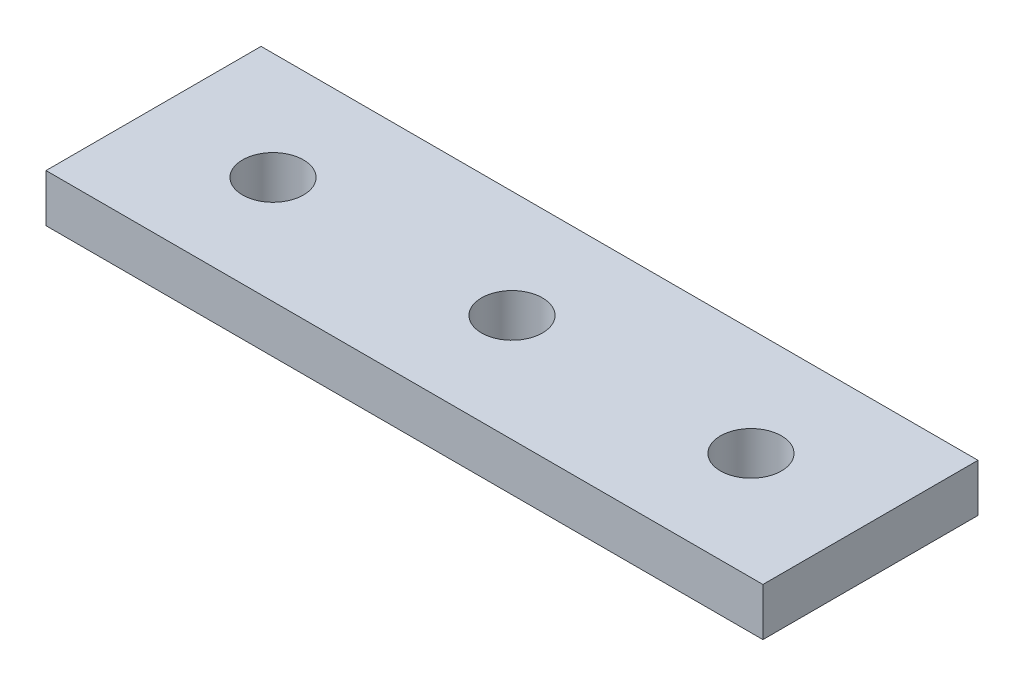
ISO-10303-21;
HEADER;
FILE_DESCRIPTION(('STEP AP214'),'2;1');
FILE_NAME('part.step','',(''),(''),'','','');
FILE_SCHEMA(('AUTOMOTIVE_DESIGN { 1 0 10303 214 1 1 1 1 }'));
ENDSEC;
DATA;
#1=APPLICATION_CONTEXT('core data for automotive mechanical design processes');
#2=APPLICATION_PROTOCOL_DEFINITION('international standard','automotive_design',2000,#1);
#3=PRODUCT_CONTEXT('',#1,'mechanical');
#4=PRODUCT('Part','Part','',(#3));
#5=PRODUCT_RELATED_PRODUCT_CATEGORY('part','',(#4));
#6=PRODUCT_DEFINITION_FORMATION('','',#4);
#7=PRODUCT_DEFINITION_CONTEXT('part definition',#1,'design');
#8=PRODUCT_DEFINITION('design','',#6,#7);
#9=PRODUCT_DEFINITION_SHAPE('','',#8);
#10=(LENGTH_UNIT() NAMED_UNIT(*) SI_UNIT(.MILLI.,.METRE.));
#11=(NAMED_UNIT(*) PLANE_ANGLE_UNIT() SI_UNIT($,.RADIAN.));
#12=(NAMED_UNIT(*) SI_UNIT($,.STERADIAN.) SOLID_ANGLE_UNIT());
#13=UNCERTAINTY_MEASURE_WITH_UNIT(LENGTH_MEASURE(1.E-05),#10,'distance_accuracy_value','');
#14=(GEOMETRIC_REPRESENTATION_CONTEXT(3) GLOBAL_UNCERTAINTY_ASSIGNED_CONTEXT((#13)) GLOBAL_UNIT_ASSIGNED_CONTEXT((#10,
#11,#12)) REPRESENTATION_CONTEXT('',''));
#15=CARTESIAN_POINT('',(0.,0.,0.));
#16=DIRECTION('',(0.,0.,1.));
#17=DIRECTION('',(1.,0.,0.));
#18=AXIS2_PLACEMENT_3D('',#15,#16,#17);
#19=CARTESIAN_POINT('',(0.,4.,0.));
#20=DIRECTION('',(0.,1.,0.));
#21=DIRECTION('',(0.,0.,1.));
#22=AXIS2_PLACEMENT_3D('',#19,#20,#21);
#23=PLANE('',#22);
#24=CARTESIAN_POINT('',(20.,4.,0.));
#25=DIRECTION('',(0.,1.,0.));
#26=DIRECTION('',(0.,0.,-1.));
#27=AXIS2_PLACEMENT_3D('',#24,#25,#26);
#28=CIRCLE('',#27,2.55);
#29=CARTESIAN_POINT('',(20.,4.,-2.55));
#30=VERTEX_POINT('',#29);
#31=EDGE_CURVE('E116',#30,#30,#28,.T.);
#32=ORIENTED_EDGE('',*,*,#31,.F.);
#33=EDGE_LOOP('',(#32));
#34=FACE_BOUND('',#33,.T.);
#35=DIRECTION('',(0.,0.,1.));
#36=VECTOR('',#35,1.);
#37=CARTESIAN_POINT('',(-30.,4.,9.00000000000001));
#38=LINE('',#37,#36);
#39=CARTESIAN_POINT('',(-30.,4.,-8.99999999999999));
#40=VERTEX_POINT('',#39);
#41=CARTESIAN_POINT('',(-30.,4.,9.00000000000001));
#42=VERTEX_POINT('',#41);
#43=EDGE_CURVE('E86',#40,#42,#38,.T.);
#44=ORIENTED_EDGE('',*,*,#43,.T.);
#45=DIRECTION('',(1.,0.,0.));
#46=VECTOR('',#45,1.);
#47=CARTESIAN_POINT('',(30.,4.,9.00000000000001));
#48=LINE('',#47,#46);
#49=CARTESIAN_POINT('',(30.,4.,9.00000000000001));
#50=VERTEX_POINT('',#49);
#51=EDGE_CURVE('E81',#42,#50,#48,.T.);
#52=ORIENTED_EDGE('',*,*,#51,.T.);
#53=DIRECTION('',(0.,0.,-1.));
#54=VECTOR('',#53,1.);
#55=CARTESIAN_POINT('',(30.,4.,9.00000000000001));
#56=LINE('',#55,#54);
#57=CARTESIAN_POINT('',(30.,4.,-8.99999999999999));
#58=VERTEX_POINT('',#57);
#59=EDGE_CURVE('E84',#50,#58,#56,.T.);
#60=ORIENTED_EDGE('',*,*,#59,.T.);
#61=DIRECTION('',(-1.,0.,0.));
#62=VECTOR('',#61,1.);
#63=CARTESIAN_POINT('',(30.,4.,-8.99999999999999));
#64=LINE('',#63,#62);
#65=EDGE_CURVE('E51',#58,#40,#64,.T.);
#66=ORIENTED_EDGE('',*,*,#65,.T.);
#67=EDGE_LOOP('',(#44,#52,#60,#66));
#68=FACE_BOUND('',#67,.T.);
#69=CARTESIAN_POINT('',(-20.,4.,0.));
#70=DIRECTION('',(0.,1.,0.));
#71=DIRECTION('',(0.,0.,1.));
#72=AXIS2_PLACEMENT_3D('',#69,#70,#71);
#73=CIRCLE('',#72,2.55);
#74=CARTESIAN_POINT('',(-20.,4.,2.55));
#75=VERTEX_POINT('',#74);
#76=EDGE_CURVE('E101',#75,#75,#73,.T.);
#77=ORIENTED_EDGE('',*,*,#76,.F.);
#78=EDGE_LOOP('',(#77));
#79=FACE_BOUND('',#78,.T.);
#80=CARTESIAN_POINT('',(0.,4.,0.));
#81=DIRECTION('',(0.,1.,0.));
#82=DIRECTION('',(0.,0.,1.));
#83=AXIS2_PLACEMENT_3D('',#80,#81,#82);
#84=CIRCLE('',#83,2.55);
#85=CARTESIAN_POINT('',(0.,4.,2.55));
#86=VERTEX_POINT('',#85);
#87=EDGE_CURVE('E122',#86,#86,#84,.T.);
#88=ORIENTED_EDGE('',*,*,#87,.F.);
#89=EDGE_LOOP('',(#88));
#90=FACE_BOUND('',#89,.T.);
#91=ADVANCED_FACE('F34',(#34,#68,#79,#90),#23,.T.);
#92=CARTESIAN_POINT('',(0.,0.,0.));
#93=DIRECTION('',(0.,1.,0.));
#94=DIRECTION('',(0.,0.,1.));
#95=AXIS2_PLACEMENT_3D('',#92,#93,#94);
#96=PLANE('',#95);
#97=CARTESIAN_POINT('',(20.,0.,0.));
#98=DIRECTION('',(0.,1.,0.));
#99=DIRECTION('',(0.,0.,-1.));
#100=AXIS2_PLACEMENT_3D('',#97,#98,#99);
#101=CIRCLE('',#100,2.55);
#102=CARTESIAN_POINT('',(20.,0.,-2.55));
#103=VERTEX_POINT('',#102);
#104=EDGE_CURVE('E119',#103,#103,#101,.T.);
#105=ORIENTED_EDGE('',*,*,#104,.T.);
#106=EDGE_LOOP('',(#105));
#107=FACE_BOUND('',#106,.T.);
#108=DIRECTION('',(0.,0.,1.));
#109=VECTOR('',#108,1.);
#110=CARTESIAN_POINT('',(-30.,0.,9.00000000000001));
#111=LINE('',#110,#109);
#112=CARTESIAN_POINT('',(-30.,0.,-8.99999999999999));
#113=VERTEX_POINT('',#112);
#114=CARTESIAN_POINT('',(-30.,0.,9.00000000000001));
#115=VERTEX_POINT('',#114);
#116=EDGE_CURVE('E98',#113,#115,#111,.T.);
#117=ORIENTED_EDGE('',*,*,#116,.F.);
#118=DIRECTION('',(-1.,0.,0.));
#119=VECTOR('',#118,1.);
#120=CARTESIAN_POINT('',(30.,0.,-8.99999999999999));
#121=LINE('',#120,#119);
#122=CARTESIAN_POINT('',(30.,0.,-8.99999999999999));
#123=VERTEX_POINT('',#122);
#124=EDGE_CURVE('E74',#123,#113,#121,.T.);
#125=ORIENTED_EDGE('',*,*,#124,.F.);
#126=DIRECTION('',(0.,0.,-1.));
#127=VECTOR('',#126,1.);
#128=CARTESIAN_POINT('',(30.,0.,9.00000000000001));
#129=LINE('',#128,#127);
#130=CARTESIAN_POINT('',(30.,0.,9.00000000000001));
#131=VERTEX_POINT('',#130);
#132=EDGE_CURVE('E68',#131,#123,#129,.T.);
#133=ORIENTED_EDGE('',*,*,#132,.F.);
#134=DIRECTION('',(1.,0.,0.));
#135=VECTOR('',#134,1.);
#136=CARTESIAN_POINT('',(30.,0.,9.00000000000001));
#137=LINE('',#136,#135);
#138=EDGE_CURVE('E90',#115,#131,#137,.T.);
#139=ORIENTED_EDGE('',*,*,#138,.F.);
#140=EDGE_LOOP('',(#117,#125,#133,#139));
#141=FACE_BOUND('',#140,.T.);
#142=CARTESIAN_POINT('',(-20.,0.,0.));
#143=DIRECTION('',(0.,1.,0.));
#144=DIRECTION('',(0.,0.,1.));
#145=AXIS2_PLACEMENT_3D('',#142,#143,#144);
#146=CIRCLE('',#145,2.55);
#147=CARTESIAN_POINT('',(-20.,0.,2.55));
#148=VERTEX_POINT('',#147);
#149=EDGE_CURVE('E113',#148,#148,#146,.T.);
#150=ORIENTED_EDGE('',*,*,#149,.T.);
#151=EDGE_LOOP('',(#150));
#152=FACE_BOUND('',#151,.T.);
#153=CARTESIAN_POINT('',(0.,0.,0.));
#154=DIRECTION('',(0.,1.,0.));
#155=DIRECTION('',(0.,0.,1.));
#156=AXIS2_PLACEMENT_3D('',#153,#154,#155);
#157=CIRCLE('',#156,2.55);
#158=CARTESIAN_POINT('',(0.,0.,2.55));
#159=VERTEX_POINT('',#158);
#160=EDGE_CURVE('E125',#159,#159,#157,.T.);
#161=ORIENTED_EDGE('',*,*,#160,.T.);
#162=EDGE_LOOP('',(#161));
#163=FACE_BOUND('',#162,.T.);
#164=ADVANCED_FACE('F109',(#107,#141,#152,#163),#96,.F.);
#165=CARTESIAN_POINT('',(-30.,4.,9.00000000000001));
#166=DIRECTION('',(1.,0.,0.));
#167=DIRECTION('',(0.,0.,-1.));
#168=AXIS2_PLACEMENT_3D('',#165,#166,#167);
#169=PLANE('',#168);
#170=ORIENTED_EDGE('',*,*,#116,.T.);
#171=DIRECTION('',(0.,-1.,0.));
#172=VECTOR('',#171,1.);
#173=CARTESIAN_POINT('',(-30.,4.,9.00000000000001));
#174=LINE('',#173,#172);
#175=EDGE_CURVE('E11',#42,#115,#174,.T.);
#176=ORIENTED_EDGE('',*,*,#175,.F.);
#177=ORIENTED_EDGE('',*,*,#43,.F.);
#178=DIRECTION('',(0.,-1.,0.));
#179=VECTOR('',#178,1.);
#180=CARTESIAN_POINT('',(-30.,4.,-8.99999999999999));
#181=LINE('',#180,#179);
#182=EDGE_CURVE('E94',#40,#113,#181,.T.);
#183=ORIENTED_EDGE('',*,*,#182,.T.);
#184=EDGE_LOOP('',(#170,#176,#177,#183));
#185=FACE_BOUND('',#184,.T.);
#186=ADVANCED_FACE('F36',(#185),#169,.F.);
#187=CARTESIAN_POINT('',(30.,4.,9.00000000000001));
#188=DIRECTION('',(0.,0.,-1.));
#189=DIRECTION('',(-1.,0.,0.));
#190=AXIS2_PLACEMENT_3D('',#187,#188,#189);
#191=PLANE('',#190);
#192=ORIENTED_EDGE('',*,*,#138,.T.);
#193=DIRECTION('',(0.,-1.,0.));
#194=VECTOR('',#193,1.);
#195=CARTESIAN_POINT('',(30.,4.,9.00000000000001));
#196=LINE('',#195,#194);
#197=EDGE_CURVE('E43',#50,#131,#196,.T.);
#198=ORIENTED_EDGE('',*,*,#197,.F.);
#199=ORIENTED_EDGE('',*,*,#51,.F.);
#200=ORIENTED_EDGE('',*,*,#175,.T.);
#201=EDGE_LOOP('',(#192,#198,#199,#200));
#202=FACE_BOUND('',#201,.T.);
#203=ADVANCED_FACE('F89',(#202),#191,.F.);
#204=CARTESIAN_POINT('',(30.,4.,9.00000000000001));
#205=DIRECTION('',(-1.,0.,0.));
#206=DIRECTION('',(0.,0.,1.));
#207=AXIS2_PLACEMENT_3D('',#204,#205,#206);
#208=PLANE('',#207);
#209=ORIENTED_EDGE('',*,*,#132,.T.);
#210=DIRECTION('',(0.,-1.,0.));
#211=VECTOR('',#210,1.);
#212=CARTESIAN_POINT('',(30.,4.,-8.99999999999999));
#213=LINE('',#212,#211);
#214=EDGE_CURVE('E91',#58,#123,#213,.T.);
#215=ORIENTED_EDGE('',*,*,#214,.F.);
#216=ORIENTED_EDGE('',*,*,#59,.F.);
#217=ORIENTED_EDGE('',*,*,#197,.T.);
#218=EDGE_LOOP('',(#209,#215,#216,#217));
#219=FACE_BOUND('',#218,.T.);
#220=ADVANCED_FACE('F92',(#219),#208,.F.);
#221=CARTESIAN_POINT('',(30.,4.,-8.99999999999999));
#222=DIRECTION('',(0.,0.,1.));
#223=DIRECTION('',(1.,0.,0.));
#224=AXIS2_PLACEMENT_3D('',#221,#222,#223);
#225=PLANE('',#224);
#226=ORIENTED_EDGE('',*,*,#124,.T.);
#227=ORIENTED_EDGE('',*,*,#182,.F.);
#228=ORIENTED_EDGE('',*,*,#65,.F.);
#229=ORIENTED_EDGE('',*,*,#214,.T.);
#230=EDGE_LOOP('',(#226,#227,#228,#229));
#231=FACE_BOUND('',#230,.T.);
#232=ADVANCED_FACE('F106',(#231),#225,.F.);
#233=CARTESIAN_POINT('',(-20.,4.,0.));
#234=DIRECTION('',(0.,-1.,0.));
#235=DIRECTION('',(0.,0.,-1.));
#236=AXIS2_PLACEMENT_3D('',#233,#234,#235);
#237=CYLINDRICAL_SURFACE('',#236,2.55);
#238=ORIENTED_EDGE('',*,*,#76,.T.);
#239=EDGE_LOOP('',(#238));
#240=FACE_BOUND('',#239,.T.);
#241=ORIENTED_EDGE('',*,*,#149,.F.);
#242=EDGE_LOOP('',(#241));
#243=FACE_BOUND('',#242,.T.);
#244=ADVANCED_FACE('F144',(#240,#243),#237,.F.);
#245=CARTESIAN_POINT('',(20.,4.,0.));
#246=DIRECTION('',(0.,-1.,0.));
#247=DIRECTION('',(0.,0.,-1.));
#248=AXIS2_PLACEMENT_3D('',#245,#246,#247);
#249=CYLINDRICAL_SURFACE('',#248,2.55);
#250=ORIENTED_EDGE('',*,*,#31,.T.);
#251=EDGE_LOOP('',(#250));
#252=FACE_BOUND('',#251,.T.);
#253=ORIENTED_EDGE('',*,*,#104,.F.);
#254=EDGE_LOOP('',(#253));
#255=FACE_BOUND('',#254,.T.);
#256=ADVANCED_FACE('F190',(#252,#255),#249,.F.);
#257=CARTESIAN_POINT('',(0.,4.,0.));
#258=DIRECTION('',(0.,-1.,0.));
#259=DIRECTION('',(0.,0.,-1.));
#260=AXIS2_PLACEMENT_3D('',#257,#258,#259);
#261=CYLINDRICAL_SURFACE('',#260,2.55);
#262=ORIENTED_EDGE('',*,*,#87,.T.);
#263=EDGE_LOOP('',(#262));
#264=FACE_BOUND('',#263,.T.);
#265=ORIENTED_EDGE('',*,*,#160,.F.);
#266=EDGE_LOOP('',(#265));
#267=FACE_BOUND('',#266,.T.);
#268=ADVANCED_FACE('F131',(#264,#267),#261,.F.);
#269=CLOSED_SHELL('',(#91,#164,#186,#203,#220,#232,#244,#256,#268));
#270=MANIFOLD_SOLID_BREP('B2',#269);
#271=ADVANCED_BREP_SHAPE_REPRESENTATION('',(#18,#270),#14);
#272=SHAPE_DEFINITION_REPRESENTATION(#9,#271);
ENDSEC;
END-ISO-10303-21;
